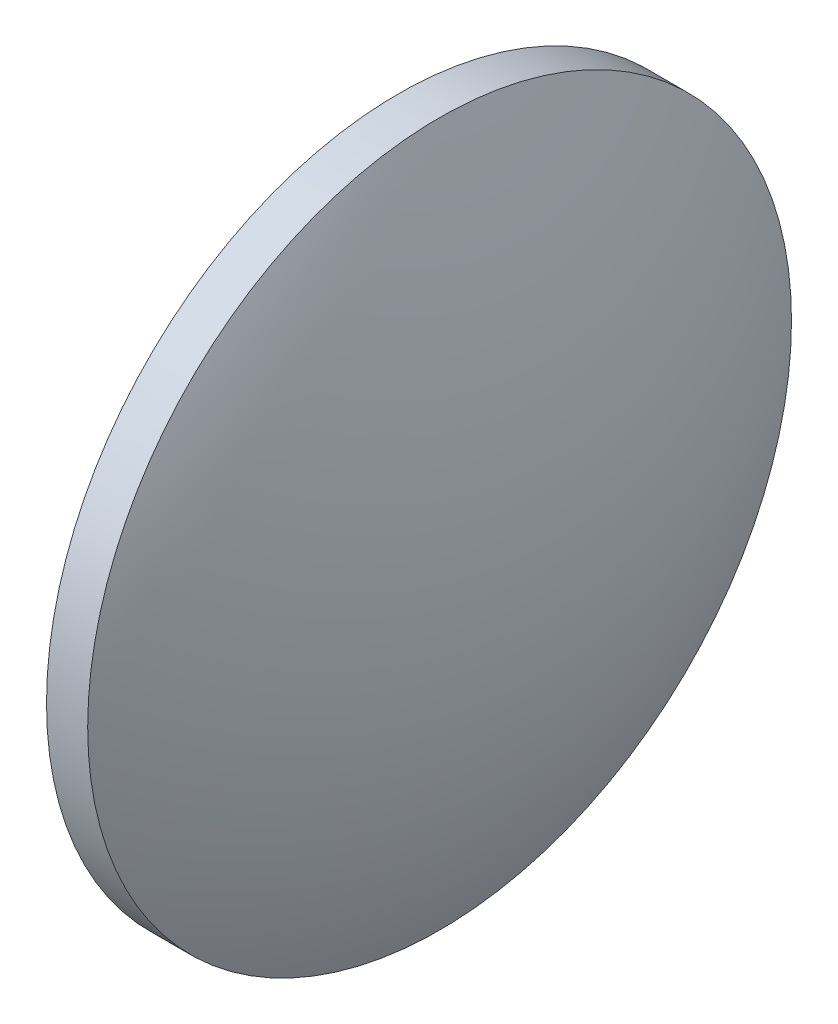
ISO-10303-21;
HEADER;
FILE_DESCRIPTION(('STEP AP214'),'2;1');
FILE_NAME('part.step','',(''),(''),'','','');
FILE_SCHEMA(('AUTOMOTIVE_DESIGN { 1 0 10303 214 1 1 1 1 }'));
ENDSEC;
DATA;
#1=APPLICATION_CONTEXT('core data for automotive mechanical design processes');
#2=APPLICATION_PROTOCOL_DEFINITION('international standard','automotive_design',2000,#1);
#3=PRODUCT_CONTEXT('',#1,'mechanical');
#4=PRODUCT('Part','Part','',(#3));
#5=PRODUCT_RELATED_PRODUCT_CATEGORY('part','',(#4));
#6=PRODUCT_DEFINITION_FORMATION('','',#4);
#7=PRODUCT_DEFINITION_CONTEXT('part definition',#1,'design');
#8=PRODUCT_DEFINITION('design','',#6,#7);
#9=PRODUCT_DEFINITION_SHAPE('','',#8);
#10=(LENGTH_UNIT() NAMED_UNIT(*) SI_UNIT(.MILLI.,.METRE.));
#11=(NAMED_UNIT(*) PLANE_ANGLE_UNIT() SI_UNIT($,.RADIAN.));
#12=(NAMED_UNIT(*) SI_UNIT($,.STERADIAN.) SOLID_ANGLE_UNIT());
#13=UNCERTAINTY_MEASURE_WITH_UNIT(LENGTH_MEASURE(1.E-05),#10,'distance_accuracy_value','');
#14=(GEOMETRIC_REPRESENTATION_CONTEXT(3) GLOBAL_UNCERTAINTY_ASSIGNED_CONTEXT((#13)) GLOBAL_UNIT_ASSIGNED_CONTEXT((#10,
#11,#12)) REPRESENTATION_CONTEXT('',''));
#15=CARTESIAN_POINT('',(0.,0.,0.));
#16=DIRECTION('',(0.,0.,1.));
#17=DIRECTION('',(1.,0.,0.));
#18=AXIS2_PLACEMENT_3D('',#15,#16,#17);
#19=CARTESIAN_POINT('',(2.5,0.,0.));
#20=DIRECTION('',(-1.,0.,0.));
#21=DIRECTION('',(0.,0.,1.));
#22=AXIS2_PLACEMENT_3D('',#19,#20,#21);
#23=CYLINDRICAL_SURFACE('',#22,21.37);
#24=CARTESIAN_POINT('',(2.5,0.,0.));
#25=DIRECTION('',(1.,0.,0.));
#26=DIRECTION('',(0.,0.,-1.));
#27=AXIS2_PLACEMENT_3D('',#24,#25,#26);
#28=CIRCLE('',#27,21.37);
#29=CARTESIAN_POINT('',(2.5,0.,-21.37));
#30=VERTEX_POINT('',#29);
#31=EDGE_CURVE('E10',#30,#30,#28,.T.);
#32=ORIENTED_EDGE('',*,*,#31,.F.);
#33=EDGE_LOOP('',(#32));
#34=FACE_BOUND('',#33,.T.);
#35=CARTESIAN_POINT('',(0.,0.,0.));
#36=DIRECTION('',(1.,0.,0.));
#37=DIRECTION('',(0.,0.,-1.));
#38=AXIS2_PLACEMENT_3D('',#35,#36,#37);
#39=CIRCLE('',#38,21.37);
#40=CARTESIAN_POINT('',(0.,0.,-21.37));
#41=VERTEX_POINT('',#40);
#42=EDGE_CURVE('E45',#41,#41,#39,.T.);
#43=ORIENTED_EDGE('',*,*,#42,.T.);
#44=EDGE_LOOP('',(#43));
#45=FACE_BOUND('',#44,.T.);
#46=ADVANCED_FACE('F37',(#34,#45),#23,.T.);
#47=CARTESIAN_POINT('',(-40.66769,0.,0.));
#48=DIRECTION('',(0.,0.,1.));
#49=DIRECTION('',(1.,0.,0.));
#50=AXIS2_PLACEMENT_3D('',#47,#48,#49);
#51=SPHERICAL_SURFACE('',#50,48.16769);
#52=CARTESIAN_POINT('',(-40.66769,0.,0.));
#53=DIRECTION('',(1.,0.,0.));
#54=DIRECTION('',(0.,0.,-1.));
#55=AXIS2_PLACEMENT_3D('',#52,#53,#54);
#56=SPHERICAL_SURFACE('',#55,48.16769);
#57=ORIENTED_EDGE('',*,*,#31,.T.);
#58=EDGE_LOOP('',(#57));
#59=FACE_BOUND('',#58,.T.);
#60=ADVANCED_FACE('F39',(#59),#56,.T.);
#61=CARTESIAN_POINT('',(0.,0.,0.));
#62=DIRECTION('',(1.,0.,0.));
#63=DIRECTION('',(0.,0.,-1.));
#64=AXIS2_PLACEMENT_3D('',#61,#62,#63);
#65=PLANE('',#64);
#66=ORIENTED_EDGE('',*,*,#42,.F.);
#67=EDGE_LOOP('',(#66));
#68=FACE_BOUND('',#67,.T.);
#69=ADVANCED_FACE('F53',(#68),#65,.F.);
#70=CLOSED_SHELL('',(#46,#60,#69));
#71=MANIFOLD_SOLID_BREP('B2',#70);
#72=ADVANCED_BREP_SHAPE_REPRESENTATION('',(#18,#71),#14);
#73=SHAPE_DEFINITION_REPRESENTATION(#9,#72);
ENDSEC;
END-ISO-10303-21;
